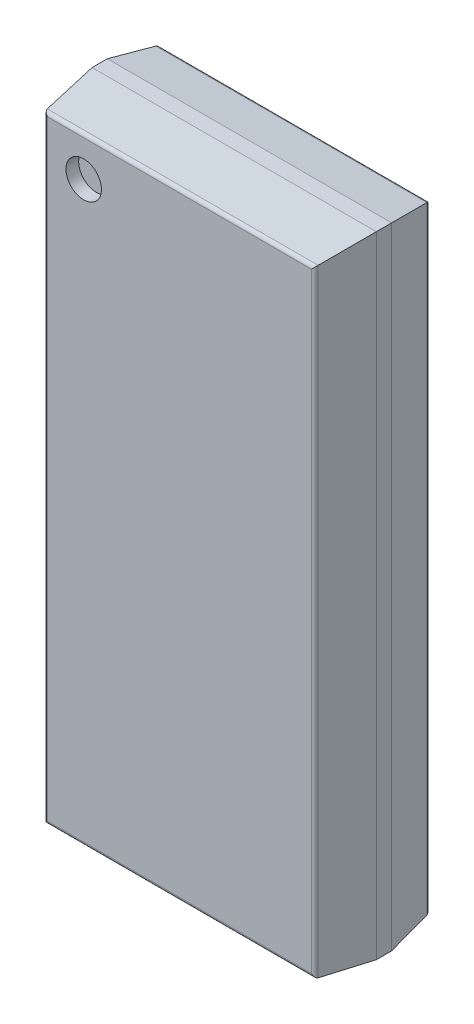
ISO-10303-21;
HEADER;
FILE_DESCRIPTION(('STEP AP214'),'2;1');
FILE_NAME('part.step','',(''),(''),'','','');
FILE_SCHEMA(('AUTOMOTIVE_DESIGN { 1 0 10303 214 1 1 1 1 }'));
ENDSEC;
DATA;
#1=APPLICATION_CONTEXT('core data for automotive mechanical design processes');
#2=APPLICATION_PROTOCOL_DEFINITION('international standard','automotive_design',2000,#1);
#3=PRODUCT_CONTEXT('',#1,'mechanical');
#4=PRODUCT('Part','Part','',(#3));
#5=PRODUCT_RELATED_PRODUCT_CATEGORY('part','',(#4));
#6=PRODUCT_DEFINITION_FORMATION('','',#4);
#7=PRODUCT_DEFINITION_CONTEXT('part definition',#1,'design');
#8=PRODUCT_DEFINITION('design','',#6,#7);
#9=PRODUCT_DEFINITION_SHAPE('','',#8);
#10=(LENGTH_UNIT() NAMED_UNIT(*) SI_UNIT(.MILLI.,.METRE.));
#11=(NAMED_UNIT(*) PLANE_ANGLE_UNIT() SI_UNIT($,.RADIAN.));
#12=(NAMED_UNIT(*) SI_UNIT($,.STERADIAN.) SOLID_ANGLE_UNIT());
#13=UNCERTAINTY_MEASURE_WITH_UNIT(LENGTH_MEASURE(1.E-05),#10,'distance_accuracy_value','');
#14=(GEOMETRIC_REPRESENTATION_CONTEXT(3) GLOBAL_UNCERTAINTY_ASSIGNED_CONTEXT((#13)) GLOBAL_UNIT_ASSIGNED_CONTEXT((#10,
#11,#12)) REPRESENTATION_CONTEXT('',''));
#15=CARTESIAN_POINT('',(0.,0.,0.));
#16=DIRECTION('',(0.,0.,1.));
#17=DIRECTION('',(1.,0.,0.));
#18=AXIS2_PLACEMENT_3D('',#15,#16,#17);
#19=CARTESIAN_POINT('',(-1.315,3.69,1.575));
#20=DIRECTION('',(0.,0.,1.));
#21=DIRECTION('',(1.,0.,0.));
#22=AXIS2_PLACEMENT_3D('',#19,#20,#21);
#23=PLANE('',#22);
#24=CARTESIAN_POINT('',(-1.315,3.69,1.575));
#25=DIRECTION('',(0.,0.,1.));
#26=DIRECTION('',(1.,0.,0.));
#27=AXIS2_PLACEMENT_3D('',#24,#25,#26);
#28=CIRCLE('',#27,0.24375);
#29=CARTESIAN_POINT('',(-1.07125,3.69,1.575));
#30=VERTEX_POINT('',#29);
#31=EDGE_CURVE('E11',#30,#30,#28,.T.);
#32=ORIENTED_EDGE('',*,*,#31,.T.);
#33=EDGE_LOOP('',(#32));
#34=FACE_BOUND('',#33,.T.);
#35=ADVANCED_FACE('F17',(#34),#23,.T.);
#36=CARTESIAN_POINT('',(-1.315,3.69,1.575));
#37=DIRECTION('',(0.,0.,1.));
#38=DIRECTION('',(1.,0.,0.));
#39=AXIS2_PLACEMENT_3D('',#36,#37,#38);
#40=CYLINDRICAL_SURFACE('',#39,0.24375);
#41=DIRECTION('',(0.,0.,1.));
#42=VECTOR('',#41,1.);
#43=CARTESIAN_POINT('',(-1.07125,3.69,1.575));
#44=LINE('',#43,#42);
#45=CARTESIAN_POINT('',(-1.07125,3.69,1.75));
#46=VERTEX_POINT('',#45);
#47=EDGE_CURVE('E20',#30,#46,#44,.T.);
#48=ORIENTED_EDGE('',*,*,#47,.T.);
#49=CARTESIAN_POINT('',(-1.315,3.69,1.75));
#50=DIRECTION('',(0.,0.,1.));
#51=DIRECTION('',(1.,0.,0.));
#52=AXIS2_PLACEMENT_3D('',#49,#50,#51);
#53=CIRCLE('',#52,0.24375);
#54=EDGE_CURVE('E212',#46,#46,#53,.T.);
#55=ORIENTED_EDGE('',*,*,#54,.T.);
#56=ORIENTED_EDGE('',*,*,#47,.F.);
#57=ORIENTED_EDGE('',*,*,#31,.F.);
#58=EDGE_LOOP('',(#48,#55,#56,#57));
#59=FACE_BOUND('',#58,.T.);
#60=ADVANCED_FACE('F335',(#59),#40,.F.);
#61=CARTESIAN_POINT('',(1.808580992189,-4.2275,1.7));
#62=DIRECTION('',(0.,1.,0.));
#63=DIRECTION('',(0.,0.,1.));
#64=AXIS2_PLACEMENT_3D('',#61,#62,#63);
#65=CYLINDRICAL_SURFACE('',#64,0.05);
#66=CARTESIAN_POINT('',(1.808580992189,-4.183580992189,1.7));
#67=DIRECTION('',(-0.707106781186548,-0.707106781186548,0.));
#68=DIRECTION('',(0.707106781186548,-0.707106781186548,0.));
#69=AXIS2_PLACEMENT_3D('',#66,#67,#68);
#70=ELLIPSE('',#69,0.07071067811865,0.05);
#71=CARTESIAN_POINT('',(1.858163522397,-4.233163522397,1.706447689371));
#72=VERTEX_POINT('',#71);
#73=CARTESIAN_POINT('',(1.808580992189,-4.183580992189,1.75));
#74=VERTEX_POINT('',#73);
#75=EDGE_CURVE('E190',#72,#74,#70,.T.);
#76=ORIENTED_EDGE('',*,*,#75,.F.);
#77=DIRECTION('',(0.,1.,0.));
#78=VECTOR('',#77,1.);
#79=CARTESIAN_POINT('',(1.858163522397,-4.2275,1.706447689371));
#80=LINE('',#79,#78);
#81=CARTESIAN_POINT('',(1.858163522397,4.233163522397,1.706447689371));
#82=VERTEX_POINT('',#81);
#83=EDGE_CURVE('E194',#72,#82,#80,.T.);
#84=ORIENTED_EDGE('',*,*,#83,.T.);
#85=CARTESIAN_POINT('',(1.808580992189,4.183580992189,1.7));
#86=DIRECTION('',(-0.707106781186548,0.707106781186548,0.));
#87=DIRECTION('',(0.707106781186548,0.707106781186548,0.));
#88=AXIS2_PLACEMENT_3D('',#85,#86,#87);
#89=ELLIPSE('',#88,0.07071067811865,0.05);
#90=CARTESIAN_POINT('',(1.808580992189,4.183580992189,1.75));
#91=VERTEX_POINT('',#90);
#92=EDGE_CURVE('E320',#91,#82,#89,.T.);
#93=ORIENTED_EDGE('',*,*,#92,.F.);
#94=DIRECTION('',(0.,1.,0.));
#95=VECTOR('',#94,1.);
#96=CARTESIAN_POINT('',(1.808580992189,-4.2275,1.75));
#97=LINE('',#96,#95);
#98=EDGE_CURVE('E213',#74,#91,#97,.T.);
#99=ORIENTED_EDGE('',*,*,#98,.F.);
#100=EDGE_LOOP('',(#76,#84,#93,#99));
#101=FACE_BOUND('',#100,.T.);
#102=ADVANCED_FACE('F397',(#101),#65,.T.);
#103=CARTESIAN_POINT('',(-1.8525,4.183580992189,1.7));
#104=DIRECTION('',(1.,0.,0.));
#105=DIRECTION('',(0.,0.,1.));
#106=AXIS2_PLACEMENT_3D('',#103,#104,#105);
#107=CYLINDRICAL_SURFACE('',#106,0.05);
#108=DIRECTION('',(1.,0.,0.));
#109=VECTOR('',#108,1.);
#110=CARTESIAN_POINT('',(-1.8525,4.183580992189,1.75));
#111=LINE('',#110,#109);
#112=CARTESIAN_POINT('',(-1.808580992189,4.183580992189,1.75));
#113=VERTEX_POINT('',#112);
#114=EDGE_CURVE('E208',#113,#91,#111,.T.);
#115=ORIENTED_EDGE('',*,*,#114,.T.);
#116=ORIENTED_EDGE('',*,*,#92,.T.);
#117=DIRECTION('',(1.,0.,0.));
#118=VECTOR('',#117,1.);
#119=CARTESIAN_POINT('',(-1.8525,4.233163522397,1.706447689371));
#120=LINE('',#119,#118);
#121=CARTESIAN_POINT('',(-1.858163522397,4.233163522397,1.706447689371));
#122=VERTEX_POINT('',#121);
#123=EDGE_CURVE('E309',#122,#82,#120,.T.);
#124=ORIENTED_EDGE('',*,*,#123,.F.);
#125=CARTESIAN_POINT('',(-1.808580992189,4.183580992189,1.7));
#126=DIRECTION('',(0.707106781186548,0.707106781186548,0.));
#127=DIRECTION('',(-0.707106781186548,0.707106781186548,0.));
#128=AXIS2_PLACEMENT_3D('',#125,#126,#127);
#129=ELLIPSE('',#128,0.07071067811865,0.05);
#130=EDGE_CURVE('E218',#122,#113,#129,.T.);
#131=ORIENTED_EDGE('',*,*,#130,.T.);
#132=EDGE_LOOP('',(#115,#116,#124,#131));
#133=FACE_BOUND('',#132,.T.);
#134=ADVANCED_FACE('F341',(#133),#107,.T.);
#135=CARTESIAN_POINT('',(-1.95,-4.325,1.75));
#136=DIRECTION('',(0.,0.,1.));
#137=DIRECTION('',(1.,0.,0.));
#138=AXIS2_PLACEMENT_3D('',#135,#136,#137);
#139=PLANE('',#138);
#140=ORIENTED_EDGE('',*,*,#54,.F.);
#141=EDGE_LOOP('',(#140));
#142=FACE_BOUND('',#141,.T.);
#143=DIRECTION('',(0.,1.,0.));
#144=VECTOR('',#143,1.);
#145=CARTESIAN_POINT('',(-1.808580992189,-4.2275,1.75));
#146=LINE('',#145,#144);
#147=CARTESIAN_POINT('',(-1.808580992189,-4.183580992189,1.75));
#148=VERTEX_POINT('',#147);
#149=EDGE_CURVE('E214',#148,#113,#146,.T.);
#150=ORIENTED_EDGE('',*,*,#149,.F.);
#151=DIRECTION('',(1.,0.,0.));
#152=VECTOR('',#151,1.);
#153=CARTESIAN_POINT('',(-1.8525,-4.183580992189,1.75));
#154=LINE('',#153,#152);
#155=EDGE_CURVE('E193',#148,#74,#154,.T.);
#156=ORIENTED_EDGE('',*,*,#155,.T.);
#157=ORIENTED_EDGE('',*,*,#98,.T.);
#158=ORIENTED_EDGE('',*,*,#114,.F.);
#159=EDGE_LOOP('',(#150,#156,#157,#158));
#160=FACE_BOUND('',#159,.T.);
#161=ADVANCED_FACE('F337',(#142,#160),#139,.T.);
#162=CARTESIAN_POINT('',(-1.8525,-4.183580992189,1.7));
#163=DIRECTION('',(1.,0.,0.));
#164=DIRECTION('',(0.,-0.991650604149876,0.128953787416984));
#165=AXIS2_PLACEMENT_3D('',#162,#163,#164);
#166=CYLINDRICAL_SURFACE('',#165,0.05);
#167=DIRECTION('',(1.,0.,0.));
#168=VECTOR('',#167,1.);
#169=CARTESIAN_POINT('',(-1.8525,-4.233163522397,1.706447689371));
#170=LINE('',#169,#168);
#171=CARTESIAN_POINT('',(-1.858163522397,-4.233163522397,1.706447689371));
#172=VERTEX_POINT('',#171);
#173=EDGE_CURVE('E305',#172,#72,#170,.T.);
#174=ORIENTED_EDGE('',*,*,#173,.T.);
#175=ORIENTED_EDGE('',*,*,#75,.T.);
#176=ORIENTED_EDGE('',*,*,#155,.F.);
#177=CARTESIAN_POINT('',(-1.808580992189,-4.183580992189,1.7));
#178=DIRECTION('',(-0.707106781186548,0.707106781186548,0.));
#179=DIRECTION('',(0.707106781186548,0.707106781186548,0.));
#180=AXIS2_PLACEMENT_3D('',#177,#178,#179);
#181=ELLIPSE('',#180,0.07071067811865,0.05);
#182=EDGE_CURVE('E219',#172,#148,#181,.T.);
#183=ORIENTED_EDGE('',*,*,#182,.F.);
#184=EDGE_LOOP('',(#174,#175,#176,#183));
#185=FACE_BOUND('',#184,.T.);
#186=ADVANCED_FACE('F340',(#185),#166,.T.);
#187=CARTESIAN_POINT('',(1.90125,-4.325,1.37511402014));
#188=DIRECTION('',(0.991650604149876,0.,0.128953787416984));
#189=DIRECTION('',(0.,-1.,0.));
#190=AXIS2_PLACEMENT_3D('',#187,#188,#189);
#191=PLANE('',#190);
#192=DIRECTION('',(-0.127894785555997,0.127894785555997,0.98350691286598));
#193=VECTOR('',#192,1.);
#194=CARTESIAN_POINT('',(1.870151108927,-4.245151108927,1.614263522754));
#195=LINE('',#194,#193);
#196=CARTESIAN_POINT('',(1.95,-4.325,1.000228040281));
#197=VERTEX_POINT('',#196);
#198=EDGE_CURVE('E200',#197,#72,#195,.T.);
#199=ORIENTED_EDGE('',*,*,#198,.F.);
#200=DIRECTION('',(0.,1.,0.));
#201=VECTOR('',#200,1.);
#202=CARTESIAN_POINT('',(1.95,-4.325,1.000228040281));
#203=LINE('',#202,#201);
#204=CARTESIAN_POINT('',(1.95,4.325,1.000228040281));
#205=VERTEX_POINT('',#204);
#206=EDGE_CURVE('E196',#197,#205,#203,.T.);
#207=ORIENTED_EDGE('',*,*,#206,.T.);
#208=DIRECTION('',(-0.127894785555997,-0.127894785555997,0.98350691286598));
#209=VECTOR('',#208,1.);
#210=CARTESIAN_POINT('',(1.799406754481,4.174406754481,2.158285402468));
#211=LINE('',#210,#209);
#212=EDGE_CURVE('E319',#205,#82,#211,.T.);
#213=ORIENTED_EDGE('',*,*,#212,.T.);
#214=ORIENTED_EDGE('',*,*,#83,.F.);
#215=EDGE_LOOP('',(#199,#207,#213,#214));
#216=FACE_BOUND('',#215,.T.);
#217=ADVANCED_FACE('F409',(#216),#191,.T.);
#218=CARTESIAN_POINT('',(-1.95,4.27625,1.37511402014));
#219=DIRECTION('',(0.,0.991650604149876,0.128953787416984));
#220=DIRECTION('',(1.,0.,0.));
#221=AXIS2_PLACEMENT_3D('',#218,#219,#220);
#222=PLANE('',#221);
#223=ORIENTED_EDGE('',*,*,#123,.T.);
#224=ORIENTED_EDGE('',*,*,#212,.F.);
#225=DIRECTION('',(1.,0.,0.));
#226=VECTOR('',#225,1.);
#227=CARTESIAN_POINT('',(-1.95,4.325,1.000228040281));
#228=LINE('',#227,#226);
#229=CARTESIAN_POINT('',(-1.95,4.325,1.000228040281));
#230=VERTEX_POINT('',#229);
#231=EDGE_CURVE('E201',#230,#205,#228,.T.);
#232=ORIENTED_EDGE('',*,*,#231,.F.);
#233=DIRECTION('',(0.127894785555997,-0.127894785555997,0.98350691286598));
#234=VECTOR('',#233,1.);
#235=CARTESIAN_POINT('',(-1.831303053017,4.206303053017,1.913003861326));
#236=LINE('',#235,#234);
#237=EDGE_CURVE('E286',#230,#122,#236,.T.);
#238=ORIENTED_EDGE('',*,*,#237,.T.);
#239=EDGE_LOOP('',(#223,#224,#232,#238));
#240=FACE_BOUND('',#239,.T.);
#241=ADVANCED_FACE('F357',(#240),#222,.T.);
#242=CARTESIAN_POINT('',(-1.808580992189,-4.2275,1.7));
#243=DIRECTION('',(0.,1.,0.));
#244=DIRECTION('',(-0.991650604149876,0.,0.128953787416984));
#245=AXIS2_PLACEMENT_3D('',#242,#243,#244);
#246=CYLINDRICAL_SURFACE('',#245,0.05);
#247=ORIENTED_EDGE('',*,*,#182,.T.);
#248=ORIENTED_EDGE('',*,*,#149,.T.);
#249=ORIENTED_EDGE('',*,*,#130,.F.);
#250=DIRECTION('',(0.,1.,0.));
#251=VECTOR('',#250,1.);
#252=CARTESIAN_POINT('',(-1.858163522397,-4.2275,1.706447689371));
#253=LINE('',#252,#251);
#254=EDGE_CURVE('E282',#172,#122,#253,.T.);
#255=ORIENTED_EDGE('',*,*,#254,.F.);
#256=EDGE_LOOP('',(#247,#248,#249,#255));
#257=FACE_BOUND('',#256,.T.);
#258=ADVANCED_FACE('F347',(#257),#246,.T.);
#259=CARTESIAN_POINT('',(-1.95,-4.27625,1.37511402014));
#260=DIRECTION('',(0.,0.991650604149876,-0.128953787416984));
#261=DIRECTION('',(-1.,0.,0.));
#262=AXIS2_PLACEMENT_3D('',#259,#260,#261);
#263=PLANE('',#262);
#264=DIRECTION('',(0.127894785555997,0.127894785555997,0.98350691286598));
#265=VECTOR('',#264,1.);
#266=CARTESIAN_POINT('',(-1.902047407463,-4.277047407463,1.368981981612));
#267=LINE('',#266,#265);
#268=CARTESIAN_POINT('',(-1.95,-4.325,1.000228040281));
#269=VERTEX_POINT('',#268);
#270=EDGE_CURVE('E296',#269,#172,#267,.T.);
#271=ORIENTED_EDGE('',*,*,#270,.F.);
#272=DIRECTION('',(1.,0.,0.));
#273=VECTOR('',#272,1.);
#274=CARTESIAN_POINT('',(-1.95,-4.325,1.000228040281));
#275=LINE('',#274,#273);
#276=EDGE_CURVE('E263',#269,#197,#275,.T.);
#277=ORIENTED_EDGE('',*,*,#276,.T.);
#278=ORIENTED_EDGE('',*,*,#198,.T.);
#279=ORIENTED_EDGE('',*,*,#173,.F.);
#280=EDGE_LOOP('',(#271,#277,#278,#279));
#281=FACE_BOUND('',#280,.T.);
#282=ADVANCED_FACE('F351',(#281),#263,.F.);
#283=CARTESIAN_POINT('',(1.95,-4.325,0.175));
#284=DIRECTION('',(1.,0.,0.));
#285=DIRECTION('',(0.,1.,0.));
#286=AXIS2_PLACEMENT_3D('',#283,#284,#285);
#287=PLANE('',#286);
#288=DIRECTION('',(0.,0.,1.));
#289=VECTOR('',#288,1.);
#290=CARTESIAN_POINT('',(1.95,-4.325,0.175));
#291=LINE('',#290,#289);
#292=CARTESIAN_POINT('',(1.95,-4.325,0.790228040281));
#293=VERTEX_POINT('',#292);
#294=EDGE_CURVE('E267',#293,#197,#291,.T.);
#295=ORIENTED_EDGE('',*,*,#294,.F.);
#296=DIRECTION('',(0.,1.,0.));
#297=VECTOR('',#296,1.);
#298=CARTESIAN_POINT('',(1.95,-4.325,0.790228040281));
#299=LINE('',#298,#297);
#300=CARTESIAN_POINT('',(1.95,4.325,0.790228040281));
#301=VERTEX_POINT('',#300);
#302=EDGE_CURVE('E253',#293,#301,#299,.T.);
#303=ORIENTED_EDGE('',*,*,#302,.T.);
#304=DIRECTION('',(0.,0.,1.));
#305=VECTOR('',#304,1.);
#306=CARTESIAN_POINT('',(1.95,4.325,0.175));
#307=LINE('',#306,#305);
#308=EDGE_CURVE('E148',#301,#205,#307,.T.);
#309=ORIENTED_EDGE('',*,*,#308,.T.);
#310=ORIENTED_EDGE('',*,*,#206,.F.);
#311=EDGE_LOOP('',(#295,#303,#309,#310));
#312=FACE_BOUND('',#311,.T.);
#313=ADVANCED_FACE('F361',(#312),#287,.T.);
#314=CARTESIAN_POINT('',(1.809799904205,-4.2275,0.225));
#315=DIRECTION('',(0.,1.,0.));
#316=DIRECTION('',(0.,0.,-1.));
#317=AXIS2_PLACEMENT_3D('',#314,#315,#316);
#318=CYLINDRICAL_SURFACE('',#317,0.05);
#319=DIRECTION('',(0.,1.,0.));
#320=VECTOR('',#319,1.);
#321=CARTESIAN_POINT('',(1.809799904205,-4.2275,0.175));
#322=LINE('',#321,#320);
#323=CARTESIAN_POINT('',(1.809799904205,-4.184799904205,0.175));
#324=VERTEX_POINT('',#323);
#325=CARTESIAN_POINT('',(1.809799904205,4.184799904205,0.175));
#326=VERTEX_POINT('',#325);
#327=EDGE_CURVE('E252',#324,#326,#322,.T.);
#328=ORIENTED_EDGE('',*,*,#327,.T.);
#329=CARTESIAN_POINT('',(1.809799904205,4.184799904205,0.225));
#330=DIRECTION('',(0.707106781186548,-0.707106781186548,0.));
#331=DIRECTION('',(0.707106781186548,0.707106781186548,0.));
#332=AXIS2_PLACEMENT_3D('',#329,#330,#331);
#333=ELLIPSE('',#332,0.07071067811865,0.05);
#334=CARTESIAN_POINT('',(1.859183608507,4.234183608507,0.217173778088));
#335=VERTEX_POINT('',#334);
#336=EDGE_CURVE('E287',#326,#335,#333,.T.);
#337=ORIENTED_EDGE('',*,*,#336,.T.);
#338=DIRECTION('',(0.,1.,0.));
#339=VECTOR('',#338,1.);
#340=CARTESIAN_POINT('',(1.859183608507,-4.2275,0.217173778088));
#341=LINE('',#340,#339);
#342=CARTESIAN_POINT('',(1.859183608507,-4.234183608507,0.217173778088));
#343=VERTEX_POINT('',#342);
#344=EDGE_CURVE('E271',#343,#335,#341,.T.);
#345=ORIENTED_EDGE('',*,*,#344,.F.);
#346=CARTESIAN_POINT('',(1.809799904205,-4.184799904205,0.225));
#347=DIRECTION('',(0.707106781186548,0.707106781186548,0.));
#348=DIRECTION('',(0.707106781186548,-0.707106781186548,0.));
#349=AXIS2_PLACEMENT_3D('',#346,#347,#348);
#350=ELLIPSE('',#349,0.07071067811865,0.05);
#351=EDGE_CURVE('E232',#343,#324,#350,.T.);
#352=ORIENTED_EDGE('',*,*,#351,.T.);
#353=EDGE_LOOP('',(#328,#337,#345,#352));
#354=FACE_BOUND('',#353,.T.);
#355=ADVANCED_FACE('F424',(#354),#318,.T.);
#356=CARTESIAN_POINT('',(-1.95,4.325,0.175));
#357=DIRECTION('',(0.,1.,0.));
#358=DIRECTION('',(1.,0.,0.));
#359=AXIS2_PLACEMENT_3D('',#356,#357,#358);
#360=PLANE('',#359);
#361=ORIENTED_EDGE('',*,*,#308,.F.);
#362=DIRECTION('',(1.,0.,0.));
#363=VECTOR('',#362,1.);
#364=CARTESIAN_POINT('',(-1.95,4.325,0.790228040281));
#365=LINE('',#364,#363);
#366=CARTESIAN_POINT('',(-1.95,4.325,0.790228040281));
#367=VERTEX_POINT('',#366);
#368=EDGE_CURVE('E141',#367,#301,#365,.T.);
#369=ORIENTED_EDGE('',*,*,#368,.F.);
#370=DIRECTION('',(0.,0.,1.));
#371=VECTOR('',#370,1.);
#372=CARTESIAN_POINT('',(-1.95,4.325,0.175));
#373=LINE('',#372,#371);
#374=EDGE_CURVE('E145',#367,#230,#373,.T.);
#375=ORIENTED_EDGE('',*,*,#374,.T.);
#376=ORIENTED_EDGE('',*,*,#231,.T.);
#377=EDGE_LOOP('',(#361,#369,#375,#376));
#378=FACE_BOUND('',#377,.T.);
#379=ADVANCED_FACE('F143',(#378),#360,.T.);
#380=CARTESIAN_POINT('',(-1.90125,-4.325,1.37511402014));
#381=DIRECTION('',(0.991650604149876,0.,-0.128953787416984));
#382=DIRECTION('',(0.,-1.,0.));
#383=AXIS2_PLACEMENT_3D('',#380,#381,#382);
#384=PLANE('',#383);
#385=ORIENTED_EDGE('',*,*,#254,.T.);
#386=ORIENTED_EDGE('',*,*,#237,.F.);
#387=DIRECTION('',(0.,1.,0.));
#388=VECTOR('',#387,1.);
#389=CARTESIAN_POINT('',(-1.95,-4.325,1.000228040281));
#390=LINE('',#389,#388);
#391=EDGE_CURVE('E165',#269,#230,#390,.T.);
#392=ORIENTED_EDGE('',*,*,#391,.F.);
#393=ORIENTED_EDGE('',*,*,#270,.T.);
#394=EDGE_LOOP('',(#385,#386,#392,#393));
#395=FACE_BOUND('',#394,.T.);
#396=ADVANCED_FACE('F354',(#395),#384,.F.);
#397=CARTESIAN_POINT('',(-1.8525,4.184799904205,0.225));
#398=DIRECTION('',(1.,0.,0.));
#399=DIRECTION('',(0.,0.,-1.));
#400=AXIS2_PLACEMENT_3D('',#397,#398,#399);
#401=CYLINDRICAL_SURFACE('',#400,0.05);
#402=CARTESIAN_POINT('',(-1.809799904205,4.184799904205,0.225));
#403=DIRECTION('',(-0.707106781186548,-0.707106781186548,0.));
#404=DIRECTION('',(-0.707106781186548,0.707106781186548,0.));
#405=AXIS2_PLACEMENT_3D('',#402,#403,#404);
#406=ELLIPSE('',#405,0.07071067811865,0.05);
#407=CARTESIAN_POINT('',(-1.859183608507,4.234183608507,0.217173778088));
#408=VERTEX_POINT('',#407);
#409=CARTESIAN_POINT('',(-1.809799904205,4.184799904205,0.175));
#410=VERTEX_POINT('',#409);
#411=EDGE_CURVE('E236',#408,#410,#406,.T.);
#412=ORIENTED_EDGE('',*,*,#411,.F.);
#413=DIRECTION('',(1.,0.,0.));
#414=VECTOR('',#413,1.);
#415=CARTESIAN_POINT('',(-1.8525,4.234183608507,0.217173778088));
#416=LINE('',#415,#414);
#417=EDGE_CURVE('E172',#408,#335,#416,.T.);
#418=ORIENTED_EDGE('',*,*,#417,.T.);
#419=ORIENTED_EDGE('',*,*,#336,.F.);
#420=DIRECTION('',(1.,0.,0.));
#421=VECTOR('',#420,1.);
#422=CARTESIAN_POINT('',(-1.8525,4.184799904205,0.175));
#423=LINE('',#422,#421);
#424=EDGE_CURVE('E248',#410,#326,#423,.T.);
#425=ORIENTED_EDGE('',*,*,#424,.F.);
#426=EDGE_LOOP('',(#412,#418,#419,#425));
#427=FACE_BOUND('',#426,.T.);
#428=ADVANCED_FACE('F369',(#427),#401,.T.);
#429=CARTESIAN_POINT('',(-1.95,-4.325,0.175));
#430=DIRECTION('',(0.,0.,1.));
#431=DIRECTION('',(1.,0.,0.));
#432=AXIS2_PLACEMENT_3D('',#429,#430,#431);
#433=PLANE('',#432);
#434=ORIENTED_EDGE('',*,*,#424,.T.);
#435=ORIENTED_EDGE('',*,*,#327,.F.);
#436=DIRECTION('',(1.,0.,0.));
#437=VECTOR('',#436,1.);
#438=CARTESIAN_POINT('',(-1.8525,-4.184799904205,0.175));
#439=LINE('',#438,#437);
#440=CARTESIAN_POINT('',(-1.809799904205,-4.184799904205,0.175));
#441=VERTEX_POINT('',#440);
#442=EDGE_CURVE('E228',#441,#324,#439,.T.);
#443=ORIENTED_EDGE('',*,*,#442,.F.);
#444=DIRECTION('',(0.,1.,0.));
#445=VECTOR('',#444,1.);
#446=CARTESIAN_POINT('',(-1.809799904205,-4.2275,0.175));
#447=LINE('',#446,#445);
#448=EDGE_CURVE('E237',#441,#410,#447,.T.);
#449=ORIENTED_EDGE('',*,*,#448,.T.);
#450=EDGE_LOOP('',(#434,#435,#443,#449));
#451=FACE_BOUND('',#450,.T.);
#452=ADVANCED_FACE('F389',(#451),#433,.F.);
#453=CARTESIAN_POINT('',(1.90125,-4.325,0.48261402014));
#454=DIRECTION('',(-0.987674086040775,0.,0.156524438230965));
#455=DIRECTION('',(0.,1.,0.));
#456=AXIS2_PLACEMENT_3D('',#453,#454,#455);
#457=PLANE('',#456);
#458=ORIENTED_EDGE('',*,*,#344,.T.);
#459=DIRECTION('',(-0.154641549855072,-0.154641549855072,-0.975793001674455));
#460=VECTOR('',#459,1.);
#461=CARTESIAN_POINT('',(1.752355401828,4.127355401828,-0.456915537213));
#462=LINE('',#461,#460);
#463=EDGE_CURVE('E154',#301,#335,#462,.T.);
#464=ORIENTED_EDGE('',*,*,#463,.F.);
#465=ORIENTED_EDGE('',*,*,#302,.F.);
#466=DIRECTION('',(-0.154641549855072,0.154641549855072,-0.975793001674455));
#467=VECTOR('',#466,1.);
#468=CARTESIAN_POINT('',(1.8557834905,-4.2307834905,0.195718927441));
#469=LINE('',#468,#467);
#470=EDGE_CURVE('E223',#293,#343,#469,.T.);
#471=ORIENTED_EDGE('',*,*,#470,.T.);
#472=EDGE_LOOP('',(#458,#464,#465,#471));
#473=FACE_BOUND('',#472,.T.);
#474=ADVANCED_FACE('F364',(#473),#457,.F.);
#475=CARTESIAN_POINT('',(-1.95,-4.325,0.175));
#476=DIRECTION('',(0.,1.,0.));
#477=DIRECTION('',(1.,0.,0.));
#478=AXIS2_PLACEMENT_3D('',#475,#476,#477);
#479=PLANE('',#478);
#480=ORIENTED_EDGE('',*,*,#276,.F.);
#481=DIRECTION('',(0.,0.,1.));
#482=VECTOR('',#481,1.);
#483=CARTESIAN_POINT('',(-1.95,-4.325,0.175));
#484=LINE('',#483,#482);
#485=CARTESIAN_POINT('',(-1.95,-4.325,0.790228040281));
#486=VERTEX_POINT('',#485);
#487=EDGE_CURVE('E155',#486,#269,#484,.T.);
#488=ORIENTED_EDGE('',*,*,#487,.F.);
#489=DIRECTION('',(1.,0.,0.));
#490=VECTOR('',#489,1.);
#491=CARTESIAN_POINT('',(-1.95,-4.325,0.790228040281));
#492=LINE('',#491,#490);
#493=EDGE_CURVE('E227',#486,#293,#492,.T.);
#494=ORIENTED_EDGE('',*,*,#493,.T.);
#495=ORIENTED_EDGE('',*,*,#294,.T.);
#496=EDGE_LOOP('',(#480,#488,#494,#495));
#497=FACE_BOUND('',#496,.T.);
#498=ADVANCED_FACE('F378',(#497),#479,.F.);
#499=CARTESIAN_POINT('',(-1.8525,-4.184799904205,0.225));
#500=DIRECTION('',(1.,0.,0.));
#501=DIRECTION('',(0.,-0.987674086040775,-0.156524438230965));
#502=AXIS2_PLACEMENT_3D('',#499,#500,#501);
#503=CYLINDRICAL_SURFACE('',#502,0.05);
#504=CARTESIAN_POINT('',(-1.809799904205,-4.184799904205,0.225));
#505=DIRECTION('',(0.707106781186548,-0.707106781186548,0.));
#506=DIRECTION('',(0.707106781186548,0.707106781186548,0.));
#507=AXIS2_PLACEMENT_3D('',#504,#505,#506);
#508=ELLIPSE('',#507,0.07071067811865,0.05);
#509=CARTESIAN_POINT('',(-1.859183608507,-4.234183608507,0.217173778088));
#510=VERTEX_POINT('',#509);
#511=EDGE_CURVE('E241',#510,#441,#508,.T.);
#512=ORIENTED_EDGE('',*,*,#511,.T.);
#513=ORIENTED_EDGE('',*,*,#442,.T.);
#514=ORIENTED_EDGE('',*,*,#351,.F.);
#515=DIRECTION('',(1.,0.,0.));
#516=VECTOR('',#515,1.);
#517=CARTESIAN_POINT('',(-1.8525,-4.234183608507,0.217173778088));
#518=LINE('',#517,#516);
#519=EDGE_CURVE('E205',#510,#343,#518,.T.);
#520=ORIENTED_EDGE('',*,*,#519,.F.);
#521=EDGE_LOOP('',(#512,#513,#514,#520));
#522=FACE_BOUND('',#521,.T.);
#523=ADVANCED_FACE('F380',(#522),#503,.T.);
#524=CARTESIAN_POINT('',(-1.95,4.27625,0.48261402014));
#525=DIRECTION('',(0.,-0.987674086040775,0.156524438230965));
#526=DIRECTION('',(-1.,0.,0.));
#527=AXIS2_PLACEMENT_3D('',#524,#525,#526);
#528=PLANE('',#527);
#529=DIRECTION('',(0.154641549855072,-0.154641549855072,-0.975793001674455));
#530=VECTOR('',#529,1.);
#531=CARTESIAN_POINT('',(-1.798987719264,4.173987719264,-0.162664160085));
#532=LINE('',#531,#530);
#533=EDGE_CURVE('E169',#367,#408,#532,.T.);
#534=ORIENTED_EDGE('',*,*,#533,.F.);
#535=ORIENTED_EDGE('',*,*,#368,.T.);
#536=ORIENTED_EDGE('',*,*,#463,.T.);
#537=ORIENTED_EDGE('',*,*,#417,.F.);
#538=EDGE_LOOP('',(#534,#535,#536,#537));
#539=FACE_BOUND('',#538,.T.);
#540=ADVANCED_FACE('F170',(#539),#528,.F.);
#541=CARTESIAN_POINT('',(-1.95,-4.325,0.175));
#542=DIRECTION('',(1.,0.,0.));
#543=DIRECTION('',(0.,1.,0.));
#544=AXIS2_PLACEMENT_3D('',#541,#542,#543);
#545=PLANE('',#544);
#546=ORIENTED_EDGE('',*,*,#391,.T.);
#547=ORIENTED_EDGE('',*,*,#374,.F.);
#548=DIRECTION('',(0.,1.,0.));
#549=VECTOR('',#548,1.);
#550=CARTESIAN_POINT('',(-1.95,-4.325,0.790228040281));
#551=LINE('',#550,#549);
#552=EDGE_CURVE('E162',#486,#367,#551,.T.);
#553=ORIENTED_EDGE('',*,*,#552,.F.);
#554=ORIENTED_EDGE('',*,*,#487,.T.);
#555=EDGE_LOOP('',(#546,#547,#553,#554));
#556=FACE_BOUND('',#555,.T.);
#557=ADVANCED_FACE('F159',(#556),#545,.F.);
#558=CARTESIAN_POINT('',(-1.809799904205,-4.2275,0.225));
#559=DIRECTION('',(0.,1.,0.));
#560=DIRECTION('',(-0.987674086040775,0.,-0.156524438230965));
#561=AXIS2_PLACEMENT_3D('',#558,#559,#560);
#562=CYLINDRICAL_SURFACE('',#561,0.05);
#563=DIRECTION('',(0.,1.,0.));
#564=VECTOR('',#563,1.);
#565=CARTESIAN_POINT('',(-1.859183608507,-4.2275,0.217173778088));
#566=LINE('',#565,#564);
#567=EDGE_CURVE('E177',#510,#408,#566,.T.);
#568=ORIENTED_EDGE('',*,*,#567,.T.);
#569=ORIENTED_EDGE('',*,*,#411,.T.);
#570=ORIENTED_EDGE('',*,*,#448,.F.);
#571=ORIENTED_EDGE('',*,*,#511,.F.);
#572=EDGE_LOOP('',(#568,#569,#570,#571));
#573=FACE_BOUND('',#572,.T.);
#574=ADVANCED_FACE('F372',(#573),#562,.T.);
#575=CARTESIAN_POINT('',(-1.95,-4.27625,0.48261402014));
#576=DIRECTION('',(0.,-0.987674086040775,-0.156524438230965));
#577=DIRECTION('',(0.,0.156524438230965,-0.987674086040775));
#578=AXIS2_PLACEMENT_3D('',#575,#576,#577);
#579=PLANE('',#578);
#580=ORIENTED_EDGE('',*,*,#519,.T.);
#581=ORIENTED_EDGE('',*,*,#470,.F.);
#582=ORIENTED_EDGE('',*,*,#493,.F.);
#583=DIRECTION('',(0.154641549855072,0.154641549855072,-0.975793001674455));
#584=VECTOR('',#583,1.);
#585=CARTESIAN_POINT('',(-1.902415807936,-4.277415807936,0.489970304569));
#586=LINE('',#585,#584);
#587=EDGE_CURVE('E181',#486,#510,#586,.T.);
#588=ORIENTED_EDGE('',*,*,#587,.T.);
#589=EDGE_LOOP('',(#580,#581,#582,#588));
#590=FACE_BOUND('',#589,.T.);
#591=ADVANCED_FACE('F376',(#590),#579,.T.);
#592=CARTESIAN_POINT('',(-1.90125,-4.325,0.48261402014));
#593=DIRECTION('',(-0.987674086040775,0.,-0.156524438230965));
#594=DIRECTION('',(-0.156524438230965,0.,0.987674086040775));
#595=AXIS2_PLACEMENT_3D('',#592,#593,#594);
#596=PLANE('',#595);
#597=ORIENTED_EDGE('',*,*,#587,.F.);
#598=ORIENTED_EDGE('',*,*,#552,.T.);
#599=ORIENTED_EDGE('',*,*,#533,.T.);
#600=ORIENTED_EDGE('',*,*,#567,.F.);
#601=EDGE_LOOP('',(#597,#598,#599,#600));
#602=FACE_BOUND('',#601,.T.);
#603=ADVANCED_FACE('F179',(#602),#596,.T.);
#604=CLOSED_SHELL('',(#35,#60,#102,#134,#161,#186,#217,#241,#258,#282,#313,#355,#379,#396,#428,
#452,#474,#498,#523,#540,#557,#574,#591,#603));
#605=MANIFOLD_SOLID_BREP('B1',#604);
#606=ADVANCED_BREP_SHAPE_REPRESENTATION('',(#18,#605),#14);
#607=SHAPE_DEFINITION_REPRESENTATION(#9,#606);
ENDSEC;
END-ISO-10303-21;
